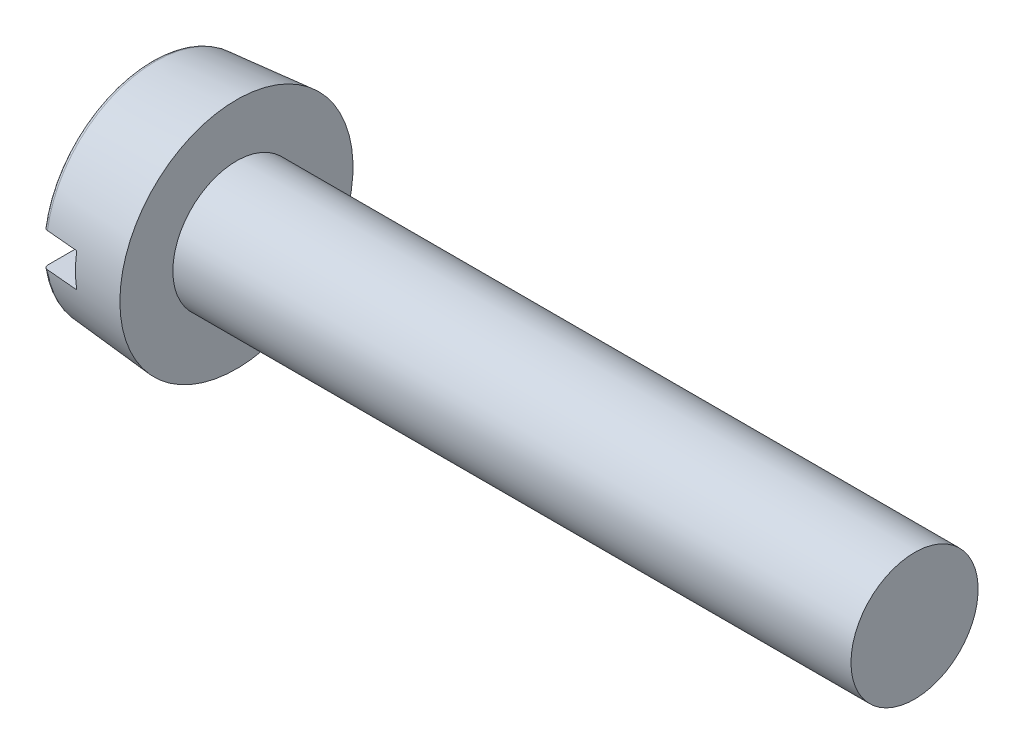
ISO-10303-21;
HEADER;
FILE_DESCRIPTION(('STEP AP214'),'2;1');
FILE_NAME('part.step','',(''),(''),'','','');
FILE_SCHEMA(('AUTOMOTIVE_DESIGN { 1 0 10303 214 1 1 1 1 }'));
ENDSEC;
DATA;
#1=APPLICATION_CONTEXT('core data for automotive mechanical design processes');
#2=APPLICATION_PROTOCOL_DEFINITION('international standard','automotive_design',2000,#1);
#3=PRODUCT_CONTEXT('',#1,'mechanical');
#4=PRODUCT('Part','Part','',(#3));
#5=PRODUCT_RELATED_PRODUCT_CATEGORY('part','',(#4));
#6=PRODUCT_DEFINITION_FORMATION('','',#4);
#7=PRODUCT_DEFINITION_CONTEXT('part definition',#1,'design');
#8=PRODUCT_DEFINITION('design','',#6,#7);
#9=PRODUCT_DEFINITION_SHAPE('','',#8);
#10=(LENGTH_UNIT() NAMED_UNIT(*) SI_UNIT(.MILLI.,.METRE.));
#11=(NAMED_UNIT(*) PLANE_ANGLE_UNIT() SI_UNIT($,.RADIAN.));
#12=(NAMED_UNIT(*) SI_UNIT($,.STERADIAN.) SOLID_ANGLE_UNIT());
#13=UNCERTAINTY_MEASURE_WITH_UNIT(LENGTH_MEASURE(1.E-05),#10,'distance_accuracy_value','');
#14=(GEOMETRIC_REPRESENTATION_CONTEXT(3) GLOBAL_UNCERTAINTY_ASSIGNED_CONTEXT((#13)) GLOBAL_UNIT_ASSIGNED_CONTEXT((#10,
#11,#12)) REPRESENTATION_CONTEXT('',''));
#15=CARTESIAN_POINT('',(0.,0.,0.));
#16=DIRECTION('',(0.,0.,1.));
#17=DIRECTION('',(1.,0.,0.));
#18=AXIS2_PLACEMENT_3D('',#15,#16,#17);
#19=CARTESIAN_POINT('',(0.,0.,0.));
#20=DIRECTION('',(-1.,0.,0.));
#21=DIRECTION('',(0.,0.,1.));
#22=AXIS2_PLACEMENT_3D('',#19,#20,#21);
#23=PLANE('',#22);
#24=DIRECTION('',(0.,0.,-1.));
#25=VECTOR('',#24,1.);
#26=CARTESIAN_POINT('',(0.,0.399999999999999,2.75));
#27=LINE('',#26,#25);
#28=CARTESIAN_POINT('',(0.,0.399999999999999,2.45096382768024));
#29=VERTEX_POINT('',#28);
#30=CARTESIAN_POINT('',(0.,0.399999999999999,-2.45096382768024));
#31=VERTEX_POINT('',#30);
#32=EDGE_CURVE('E103',#29,#31,#27,.T.);
#33=ORIENTED_EDGE('',*,*,#32,.F.);
#34=CARTESIAN_POINT('',(0.,0.,0.));
#35=DIRECTION('',(-1.,0.,0.));
#36=DIRECTION('',(0.,0.,1.));
#37=AXIS2_PLACEMENT_3D('',#34,#35,#36);
#38=CIRCLE('',#37,2.48338955554641);
#39=EDGE_CURVE('E105',#29,#31,#38,.T.);
#40=ORIENTED_EDGE('',*,*,#39,.T.);
#41=EDGE_LOOP('',(#33,#40));
#42=FACE_BOUND('',#41,.T.);
#43=ADVANCED_FACE('F35',(#42),#23,.T.);
#44=CARTESIAN_POINT('',(0.1,0.,0.));
#45=DIRECTION('',(-1.,0.,0.));
#46=DIRECTION('',(0.,0.,1.));
#47=AXIS2_PLACEMENT_3D('',#44,#45,#46);
#48=TOROIDAL_SURFACE('',#47,2.48338955554641,0.1);
#49=CARTESIAN_POINT('',(0.0289938380211767,0.399999999999999,-2.52228316549766));
#50=CARTESIAN_POINT('',(0.0329146400399018,0.399999999999999,-2.52628601737879));
#51=CARTESIAN_POINT('',(0.0371732059087869,0.399999999999999,-2.52996330795833));
#52=CARTESIAN_POINT('',(0.0462494374841135,0.399999999999999,-2.53655558833691));
#53=CARTESIAN_POINT('',(0.0510676904570537,0.399999999999999,-2.53946976679747));
#54=CARTESIAN_POINT('',(0.0611266188974553,0.399999999999999,-2.54444525866304));
#55=CARTESIAN_POINT('',(0.0663672780390162,0.399999999999999,-2.54650660501096));
#56=CARTESIAN_POINT('',(0.0771205298537048,0.399999999999999,-2.5497128714041));
#57=CARTESIAN_POINT('',(0.0826330564249989,0.399999999999999,-2.55085801306043));
#58=CARTESIAN_POINT('',(0.0937360108304339,0.399999999999999,-2.55219318080891));
#59=CARTESIAN_POINT('',(0.0993256947509518,0.399999999999999,-2.55238939597481));
#60=CARTESIAN_POINT('',(0.110458306622039,0.399999999999999,-2.55183747650024));
#61=CARTESIAN_POINT('',(0.116001234198318,0.399999999999999,-2.55108933430727));
#62=CARTESIAN_POINT('',(0.126865819783631,0.399999999999999,-2.54867516285271));
#63=CARTESIAN_POINT('',(0.132188090847036,0.399999999999999,-2.54701188972794));
#64=CARTESIAN_POINT('',(0.142479668135714,0.399999999999999,-2.54281935144472));
#65=CARTESIAN_POINT('',(0.147448970444547,0.399999999999999,-2.54029007667919));
#66=CARTESIAN_POINT('',(0.156919019556884,0.399999999999999,-2.53442699567865));
#67=CARTESIAN_POINT('',(0.161417530686885,0.399999999999999,-2.53108957986598));
#68=CARTESIAN_POINT('',(0.169797583318729,0.399999999999999,-2.52371398467404));
#69=CARTESIAN_POINT('',(0.173679096427556,0.399999999999999,-2.51967577306341));
#70=CARTESIAN_POINT('',(0.180758379631839,0.399999999999999,-2.51096934806693));
#71=CARTESIAN_POINT('',(0.183948691710374,0.399999999999999,-2.50629507144611));
#72=CARTESIAN_POINT('',(0.189510239570672,0.399999999999999,-2.49648236653712));
#73=CARTESIAN_POINT('',(0.191881421883503,0.399999999999999,-2.49134390797695));
#74=CARTESIAN_POINT('',(0.195767027940458,0.399999999999999,-2.480682205207));
#75=CARTESIAN_POINT('',(0.197270760971854,0.399999999999999,-2.47515506403468));
#76=CARTESIAN_POINT('',(0.199338128353478,0.399999999999999,-2.4639276342002));
#77=CARTESIAN_POINT('',(0.199901709526226,0.399999999999999,-2.45822733576238));
#78=CARTESIAN_POINT('',(0.20007548133907,0.399999999999999,-2.44676112412241));
#79=CARTESIAN_POINT('',(0.199677113345941,0.399999999999999,-2.44099507954687));
#80=CARTESIAN_POINT('',(0.197919889661746,0.399999999999999,-2.42961109138142));
#81=CARTESIAN_POINT('',(0.196561010768147,0.399999999999999,-2.42399315137259));
#82=CARTESIAN_POINT('',(0.192915627153958,0.399999999999999,-2.41305590565846));
#83=CARTESIAN_POINT('',(0.190627555523932,0.399999999999999,-2.40773712175833));
#84=CARTESIAN_POINT('',(0.185185000915827,0.399999999999999,-2.39756279520368));
#85=CARTESIAN_POINT('',(0.182030540035585,0.399999999999999,-2.39270724073845));
#86=CARTESIAN_POINT('',(0.174965864483063,0.399999999999999,-2.38363467595376));
#87=CARTESIAN_POINT('',(0.171060998294419,0.399999999999999,-2.37941350258364));
#88=CARTESIAN_POINT('',(0.162589830789106,0.399999999999999,-2.37169707517616));
#89=CARTESIAN_POINT('',(0.158023574903145,0.399999999999999,-2.36820177131908));
#90=CARTESIAN_POINT('',(0.148421596079081,0.399999999999999,-2.36208459946197));
#91=CARTESIAN_POINT('',(0.143392636404649,0.399999999999999,-2.35945211619946));
#92=CARTESIAN_POINT('',(0.132960042691406,0.399999999999999,-2.35508144798975));
#93=CARTESIAN_POINT('',(0.127556438263747,0.399999999999999,-2.35334319245586));
#94=CARTESIAN_POINT('',(0.116602502745338,0.399999999999999,-2.35083201602087));
#95=CARTESIAN_POINT('',(0.111054942498253,0.399999999999999,-2.35004699968965));
#96=CARTESIAN_POINT('',(0.0999070705254337,0.399999999999999,-2.3494263065429));
#97=CARTESIAN_POINT('',(0.0943067613611998,0.399999999999999,-2.34959058386431));
#98=CARTESIAN_POINT('',(0.0832511443149567,0.399999999999999,-2.35085902950957));
#99=CARTESIAN_POINT('',(0.0777951256899427,0.399999999999999,-2.3519570180145));
#100=CARTESIAN_POINT('',(0.0671440893672216,0.399999999999999,-2.35505088710293));
#101=CARTESIAN_POINT('',(0.061949072118474,0.399999999999999,-2.35704676923086));
#102=CARTESIAN_POINT('',(0.0519500535749681,0.399999999999999,-2.36188301447907));
#103=CARTESIAN_POINT('',(0.0471472182076565,0.399999999999999,-2.36472578664258));
#104=CARTESIAN_POINT('',(0.0380802947550965,0.399999999999999,-2.37116917771983));
#105=CARTESIAN_POINT('',(0.033816233965636,0.399999999999999,-2.37476983500548));
#106=CARTESIAN_POINT('',(0.0258978392798655,0.399999999999999,-2.38266730942151));
#107=CARTESIAN_POINT('',(0.0222505790304375,0.399999999999999,-2.38697121737475));
#108=CARTESIAN_POINT('',(0.0157188388685997,0.399999999999999,-2.39612333377568));
#109=CARTESIAN_POINT('',(0.0128344147286456,0.399999999999999,-2.40097158198427));
#110=CARTESIAN_POINT('',(0.00786953684593841,0.399999999999999,-2.41114518595604));
#111=CARTESIAN_POINT('',(0.00580049504437295,0.399999999999999,-2.41647611188959));
#112=CARTESIAN_POINT('',(0.00257668282239868,0.399999999999999,-2.4274074136993));
#113=CARTESIAN_POINT('',(0.0014219342122886,0.399999999999999,-2.43300779599991));
#114=CARTESIAN_POINT('',(4.98309082451504E-05,0.399999999999999,-2.44437919860998));
#115=CARTESIAN_POINT('',(-0.000158040154988933,0.399999999999999,-2.45015136490808));
#116=CARTESIAN_POINT('',(0.000395629680354001,0.399999999999999,-2.46165070249477));
#117=CARTESIAN_POINT('',(0.00115743264880536,0.399999999999999,-2.46737786119837));
#118=CARTESIAN_POINT('',(0.00363465605126339,0.399999999999999,-2.47863907342415));
#119=CARTESIAN_POINT('',(0.00535281370350065,0.399999999999999,-2.48417252398631));
#120=CARTESIAN_POINT('',(0.00969850669250414,0.399999999999999,-2.49486489969062));
#121=CARTESIAN_POINT('',(0.0123249394519192,0.399999999999999,-2.50002426979425));
#122=CARTESIAN_POINT('',(0.0173136943959979,0.399999999999999,-2.50805181152184));
#123=CARTESIAN_POINT('',(0.01943008264062,0.399999999999999,-2.51107561025656));
#124=CARTESIAN_POINT('',(0.0239801784125796,0.399999999999999,-2.51687431501129));
#125=CARTESIAN_POINT('',(0.0264138847052197,0.399999999999999,-2.5196492219997));
#126=CARTESIAN_POINT('',(0.0289938380211767,0.399999999999999,-2.52228316549766));
#127=B_SPLINE_CURVE_WITH_KNOTS('',3,(#49,#50,#51,#52,#53,#54,#55,#56,#57,#58,#59,#60,#61,#62,
#63,#64,#65,#66,#67,#68,#69,#70,#71,#72,#73,#74,#75,#76,#77,#78,#79,#80,#81,#82,#83,#84,#85,#86,
#87,#88,#89,#90,#91,#92,#93,#94,#95,#96,#97,#98,#99,#100,#101,#102,#103,#104,#105,#106,#107,
#108,#109,#110,#111,#112,#113,#114,#115,#116,#117,#118,#119,#120,#121,#122,#123,#124,#125,#126),
.UNSPECIFIED.,.T.,.F.,(4,2,2,2,2,2,2,2,2,2,2,2,2,2,2,2,2,2,2,2,2,2,2,2,2,2,2,2,2,2,2,2,2,2,2,2,
2,2,4),(0.,0.0167962438770804,0.0336102736228912,0.0504236538216825,0.06723296597852,
0.0839324954656499,0.100632158508098,0.117281799647169,0.133931625497132,0.150657236214899,
0.167383616389182,0.184282358747594,0.201182203967944,0.218286107817179,0.235390979075726,
0.252648595290838,0.269906628402956,0.287193885606231,0.304480701927405,0.321648593971803,
0.338815307316328,0.355762112546912,0.372707579860325,0.389435704571816,0.406163021106999,
0.422780481006365,0.439397969489147,0.456063186523275,0.47272924752445,0.489575093862967,
0.506422171494332,0.523497308438318,0.540572852694337,0.55781904957641,0.575069908508114,
0.592370397548948,0.609649958399181,0.620702210843321,0.631754420283977),.UNSPECIFIED.);
#128=CARTESIAN_POINT('',(0.0912844257252334,0.399999999999999,-2.5518494518816));
#129=VERTEX_POINT('',#128);
#130=EDGE_CURVE('E59',#31,#129,#127,.T.);
#131=ORIENTED_EDGE('',*,*,#130,.F.);
#132=ORIENTED_EDGE('',*,*,#39,.F.);
#133=CARTESIAN_POINT('',(0.0367676987021643,0.399999999999999,2.37243473528728));
#134=CARTESIAN_POINT('',(0.0410691072562518,0.399999999999999,2.36887462682049));
#135=CARTESIAN_POINT('',(0.0456712476146379,0.399999999999999,2.36567202074306));
#136=CARTESIAN_POINT('',(0.0553504912178822,0.399999999999999,2.36008032650183));
#137=CARTESIAN_POINT('',(0.0604280839551132,0.399999999999999,2.35769208875703));
#138=CARTESIAN_POINT('',(0.0709135886904199,0.399999999999999,2.35380489827384));
#139=CARTESIAN_POINT('',(0.0763214938192331,0.399999999999999,2.35230592704897));
#140=CARTESIAN_POINT('',(0.0873116719417479,0.399999999999999,2.35024450872371));
#141=CARTESIAN_POINT('',(0.0928939027986416,0.399999999999999,2.34968183706536));
#142=CARTESIAN_POINT('',(0.104036601297581,0.399999999999999,2.34951039508072));
#143=CARTESIAN_POINT('',(0.109596974662459,0.399999999999999,2.34989545024077));
#144=CARTESIAN_POINT('',(0.120573920357346,0.399999999999999,2.35159460899385));
#145=CARTESIAN_POINT('',(0.125990490202903,0.399999999999999,2.35290872862725));
#146=CARTESIAN_POINT('',(0.136522391247531,0.399999999999999,2.35642416504567));
#147=CARTESIAN_POINT('',(0.141637967615106,0.399999999999999,2.35862474798458));
#148=CARTESIAN_POINT('',(0.151431222534294,0.399999999999999,2.36384674458521));
#149=CARTESIAN_POINT('',(0.156108887376012,0.399999999999999,2.36686818393429));
#150=CARTESIAN_POINT('',(0.164936002938918,0.399999999999999,2.37367095440966));
#151=CARTESIAN_POINT('',(0.16908079389346,0.399999999999999,2.3774583297866));
#152=CARTESIAN_POINT('',(0.176685910750912,0.399999999999999,2.38566704388047));
#153=CARTESIAN_POINT('',(0.180146192360979,0.399999999999999,2.39008842359027));
#154=CARTESIAN_POINT('',(0.186332746435633,0.399999999999999,2.39950205527751));
#155=CARTESIAN_POINT('',(0.189048713902265,0.399999999999999,2.40450107962601));
#156=CARTESIAN_POINT('',(0.193614409893133,0.399999999999999,2.41488017557624));
#157=CARTESIAN_POINT('',(0.195464077650946,0.399999999999999,2.42026027387786));
#158=CARTESIAN_POINT('',(0.198266231334811,0.399999999999999,2.43131856240102));
#159=CARTESIAN_POINT('',(0.199207620171234,0.399999999999999,2.43699956654937));
#160=CARTESIAN_POINT('',(0.20012925691986,0.399999999999999,2.4484391128062));
#161=CARTESIAN_POINT('',(0.200109464431673,0.399999999999999,2.45419765816372));
#162=CARTESIAN_POINT('',(0.199105792419158,0.399999999999999,2.46566309979117));
#163=CARTESIAN_POINT('',(0.198116473192368,0.399999999999999,2.47136952123461));
#164=CARTESIAN_POINT('',(0.195191128966346,0.399999999999999,2.48253449565389));
#165=CARTESIAN_POINT('',(0.193255106776879,0.399999999999999,2.48799304936533));
#166=CARTESIAN_POINT('',(0.188494675278442,0.399999999999999,2.49848893070217));
#167=CARTESIAN_POINT('',(0.185672880951563,0.399999999999999,2.50352744366316));
#168=CARTESIAN_POINT('',(0.17921549855744,0.399999999999999,2.51305299197626));
#169=CARTESIAN_POINT('',(0.175579948629359,0.399999999999999,2.51754005315861));
#170=CARTESIAN_POINT('',(0.167635478825505,0.399999999999999,2.52578731588122));
#171=CARTESIAN_POINT('',(0.163333512373971,0.399999999999999,2.5295542142048));
#172=CARTESIAN_POINT('',(0.154151555490121,0.399999999999999,2.53630156216166));
#173=CARTESIAN_POINT('',(0.149271604711318,0.399999999999999,2.53928206570155));
#174=CARTESIAN_POINT('',(0.13913635307135,0.399999999999999,2.54433379308572));
#175=CARTESIAN_POINT('',(0.133886369113007,0.399999999999999,2.54641568563766));
#176=CARTESIAN_POINT('',(0.123109394747461,0.399999999999999,2.54965893225548));
#177=CARTESIAN_POINT('',(0.117582421034199,0.399999999999999,2.55082034172732));
#178=CARTESIAN_POINT('',(0.106464698916145,0.399999999999999,2.55218028189334));
#179=CARTESIAN_POINT('',(0.100875054594367,0.399999999999999,2.55238785185234));
#180=CARTESIAN_POINT('',(0.0897407847209886,0.399999999999999,2.55185843737951));
#181=CARTESIAN_POINT('',(0.0841961579348967,0.399999999999999,2.55112147893765));
#182=CARTESIAN_POINT('',(0.073326565726689,0.399999999999999,2.54872918263962));
#183=CARTESIAN_POINT('',(0.0680009847337695,0.399999999999999,2.54707663871121));
#184=CARTESIAN_POINT('',(0.0577010526378296,0.399999999999999,2.54290481605141));
#185=CARTESIAN_POINT('',(0.0527267057044026,0.399999999999999,2.54038552703274));
#186=CARTESIAN_POINT('',(0.0432451955154218,0.399999999999999,2.53454156724995));
#187=CARTESIAN_POINT('',(0.0387402389480661,0.399999999999999,2.53121331773258));
#188=CARTESIAN_POINT('',(0.0303458654217718,0.399999999999999,2.52385482922166));
#189=CARTESIAN_POINT('',(0.0264564786942823,0.399999999999999,2.51982455577117));
#190=CARTESIAN_POINT('',(0.0193602742266986,0.399999999999999,2.51113277232454));
#191=CARTESIAN_POINT('',(0.0161608831052451,0.399999999999999,2.50646520000313));
#192=CARTESIAN_POINT('',(0.0105801862776837,0.399999999999999,2.49666430232761));
#193=CARTESIAN_POINT('',(0.00819893477648342,0.399999999999999,2.491530946142));
#194=CARTESIAN_POINT('',(0.00429230007908598,0.399999999999999,2.48087765570879));
#195=CARTESIAN_POINT('',(0.00277761888662455,0.399999999999999,2.47535379620009));
#196=CARTESIAN_POINT('',(0.00068799544056719,0.399999999999999,2.46413127035624));
#197=CARTESIAN_POINT('',(0.000113070892212571,0.399999999999999,2.45843260072968));
#198=CARTESIAN_POINT('',(-8.37002456024676E-05,0.399999999999999,2.44696818040157));
#199=CARTESIAN_POINT('',(0.00030294133576769,0.399999999999999,2.44120228266165));
#200=CARTESIAN_POINT('',(0.00203701001733569,0.399999999999999,2.42981508207598));
#201=CARTESIAN_POINT('',(0.00338469494754012,0.399999999999999,2.42419381845226));
#202=CARTESIAN_POINT('',(0.00700896577894925,0.399999999999999,2.41324562761761));
#203=CARTESIAN_POINT('',(0.00928760515722943,0.399999999999999,2.40791938083122));
#204=CARTESIAN_POINT('',(0.0147114792186617,0.399999999999999,2.39773348978099));
#205=CARTESIAN_POINT('',(0.0178556585516149,0.399999999999999,2.39287328693998));
#206=CARTESIAN_POINT('',(0.0236503626604921,0.399999999999999,2.38539954815907));
#207=CARTESIAN_POINT('',(0.0260726096208588,0.399999999999999,2.38260604033144));
#208=CARTESIAN_POINT('',(0.0312086078085589,0.399999999999999,2.37730112356));
#209=CARTESIAN_POINT('',(0.0339223576900255,0.399999999999999,2.37478971331387));
#210=CARTESIAN_POINT('',(0.0367676987021643,0.399999999999999,2.37243473528728));
#211=B_SPLINE_CURVE_WITH_KNOTS('',3,(#133,#134,#135,#136,#137,#138,#139,#140,#141,#142,#143,
#144,#145,#146,#147,#148,#149,#150,#151,#152,#153,#154,#155,#156,#157,#158,#159,#160,#161,#162,
#163,#164,#165,#166,#167,#168,#169,#170,#171,#172,#173,#174,#175,#176,#177,#178,#179,#180,#181,
#182,#183,#184,#185,#186,#187,#188,#189,#190,#191,#192,#193,#194,#195,#196,#197,#198,#199,#200,
#201,#202,#203,#204,#205,#206,#207,#208,#209,#210),.UNSPECIFIED.,.T.,.F.,(4,2,2,2,2,2,2,2,2,2,2,
2,2,2,2,2,2,2,2,2,2,2,2,2,2,2,2,2,2,2,2,2,2,2,2,2,2,2,4),(0.,0.0167374978406355,
0.0334924209723803,0.0502469957829488,0.0669975516708022,0.0836392656129615,0.100281266882441,
0.116909519525703,0.133538292583203,0.150303803185788,0.167070398286947,0.18405857971598,
0.201047952599288,0.218242362613188,0.235437495343469,0.252729660021829,0.270021773378246,
0.287263309496308,0.304504037705845,0.321575685446243,0.338646162637365,0.35550798995053,
0.372368802234774,0.389069495340301,0.405769728913956,0.422419279849294,0.439069028402679,
0.455793818907913,0.472519430535029,0.489416954805598,0.506315598386582,0.523418666684378,
0.540522057204383,0.557776961903069,0.57503649751328,0.592334311120995,0.609611126268918,
0.620682873655479,0.631754569926062),.UNSPECIFIED.);
#212=CARTESIAN_POINT('',(0.0912844257243818,0.399999999999999,2.55184945188522));
#213=VERTEX_POINT('',#212);
#214=EDGE_CURVE('E95',#213,#29,#211,.T.);
#215=ORIENTED_EDGE('',*,*,#214,.F.);
#216=CARTESIAN_POINT('',(0.0912844257252333,0.,0.));
#217=DIRECTION('',(-1.,0.,0.));
#218=DIRECTION('',(0.,0.,1.));
#219=AXIS2_PLACEMENT_3D('',#216,#217,#218);
#220=CIRCLE('',#219,2.58300902535558);
#221=EDGE_CURVE('E109',#129,#213,#220,.F.);
#222=ORIENTED_EDGE('',*,*,#221,.F.);
#223=EDGE_LOOP('',(#131,#132,#215,#222));
#224=FACE_BOUND('',#223,.T.);
#225=ADVANCED_FACE('F186',(#224),#48,.T.);
#226=CARTESIAN_POINT('',(-25.4,0.,0.));
#227=DIRECTION('',(-1.,0.,0.));
#228=DIRECTION('',(0.,0.,1.));
#229=AXIS2_PLACEMENT_3D('',#226,#227,#228);
#230=CYLINDRICAL_SURFACE('',#229,1.5);
#231=CARTESIAN_POINT('',(18.,0.,0.));
#232=DIRECTION('',(-1.,0.,0.));
#233=DIRECTION('',(0.,0.,1.));
#234=AXIS2_PLACEMENT_3D('',#231,#232,#233);
#235=CIRCLE('',#234,1.5);
#236=CARTESIAN_POINT('',(18.,0.,1.5));
#237=VERTEX_POINT('',#236);
#238=EDGE_CURVE('E106',#237,#237,#235,.T.);
#239=ORIENTED_EDGE('',*,*,#238,.T.);
#240=EDGE_LOOP('',(#239));
#241=FACE_BOUND('',#240,.T.);
#242=CARTESIAN_POINT('',(2.,0.,0.));
#243=DIRECTION('',(-1.,0.,0.));
#244=DIRECTION('',(0.,0.,1.));
#245=AXIS2_PLACEMENT_3D('',#242,#243,#244);
#246=CIRCLE('',#245,1.5);
#247=CARTESIAN_POINT('',(2.,0.,1.5));
#248=VERTEX_POINT('',#247);
#249=EDGE_CURVE('E173',#248,#248,#246,.T.);
#250=ORIENTED_EDGE('',*,*,#249,.F.);
#251=EDGE_LOOP('',(#250));
#252=FACE_BOUND('',#251,.T.);
#253=ADVANCED_FACE('F183',(#241,#252),#230,.T.);
#254=CARTESIAN_POINT('',(18.,1.5,0.));
#255=DIRECTION('',(1.,0.,0.));
#256=DIRECTION('',(0.,0.,-1.));
#257=AXIS2_PLACEMENT_3D('',#254,#255,#256);
#258=PLANE('',#257);
#259=ORIENTED_EDGE('',*,*,#238,.F.);
#260=EDGE_LOOP('',(#259));
#261=FACE_BOUND('',#260,.T.);
#262=ADVANCED_FACE('F185',(#261),#258,.T.);
#263=DIRECTION('',(0.,0.,1.));
#264=VECTOR('',#263,1.);
#265=CARTESIAN_POINT('',(0.,-0.4,-2.75));
#266=LINE('',#265,#264);
#267=CARTESIAN_POINT('',(0.,-0.4,-2.45096382768024));
#268=VERTEX_POINT('',#267);
#269=CARTESIAN_POINT('',(0.,-0.4,2.45096382768024));
#270=VERTEX_POINT('',#269);
#271=EDGE_CURVE('E51',#268,#270,#266,.T.);
#272=ORIENTED_EDGE('',*,*,#271,.F.);
#273=EDGE_CURVE('E101',#268,#270,#38,.T.);
#274=ORIENTED_EDGE('',*,*,#273,.T.);
#275=EDGE_LOOP('',(#272,#274));
#276=FACE_BOUND('',#275,.T.);
#277=ADVANCED_FACE('F100',(#276),#23,.T.);
#278=CARTESIAN_POINT('',(0.,0.,0.));
#279=DIRECTION('',(1.,0.,0.));
#280=DIRECTION('',(0.,0.,-1.));
#281=AXIS2_PLACEMENT_3D('',#278,#279,#280);
#282=CONICAL_SURFACE('',#281,2.57502267294815,0.0872664625997164);
#283=CARTESIAN_POINT('',(5.21123588736544,0.399999999999999,3.00443640584799));
#284=CARTESIAN_POINT('',(4.41342358696222,0.399999999999999,2.93401988873196));
#285=CARTESIAN_POINT('',(3.61561486907634,0.399999999999999,2.86356274948076));
#286=CARTESIAN_POINT('',(2.0200069246513,0.399999999999999,2.72254136292326));
#287=CARTESIAN_POINT('',(1.22220769811185,0.399999999999999,2.65197711562021));
#288=CARTESIAN_POINT('',(-0.373378996688641,0.399999999999999,2.51071564393346));
#289=CARTESIAN_POINT('',(-1.17116646494953,0.399999999999999,2.44001841954794));
#290=CARTESIAN_POINT('',(-2.76672581923324,0.399999999999999,2.298448092182));
#291=CARTESIAN_POINT('',(-3.56449770525557,0.399999999999999,2.22757498919618));
#292=CARTESIAN_POINT('',(-4.36225986914578,0.399999999999999,2.15659249784001));
#293=B_SPLINE_CURVE_WITH_KNOTS('',3,(#283,#284,#285,#286,#287,#288,#289,#290,#291,#292),
.UNSPECIFIED.,.F.,.F.,(4,2,2,2,4),(0.,2.40274147318214,4.80548287330205,7.20822430613117,
9.6109658126378),.UNSPECIFIED.);
#294=CARTESIAN_POINT('',(0.85,0.399999999999999,2.61901832187334));
#295=VERTEX_POINT('',#294);
#296=EDGE_CURVE('E162',#295,#213,#293,.T.);
#297=ORIENTED_EDGE('',*,*,#296,.F.);
#298=CARTESIAN_POINT('',(0.85,0.,0.));
#299=DIRECTION('',(1.,0.,0.));
#300=DIRECTION('',(0.,0.,-1.));
#301=AXIS2_PLACEMENT_3D('',#298,#299,#300);
#302=CIRCLE('',#301,2.64938803694519);
#303=CARTESIAN_POINT('',(0.85,-0.4,2.61901832187334));
#304=VERTEX_POINT('',#303);
#305=EDGE_CURVE('E11',#304,#295,#302,.F.);
#306=ORIENTED_EDGE('',*,*,#305,.F.);
#307=CARTESIAN_POINT('',(-4.36225986914578,-0.4,2.15659249784001));
#308=CARTESIAN_POINT('',(-3.02252879329932,-0.4,2.27578971400985));
#309=CARTESIAN_POINT('',(-1.68277158070833,-0.4,2.3946924855258));
#310=CARTESIAN_POINT('',(-0.0871929715729522,-0.4,2.5360455579839));
#311=CARTESIAN_POINT('',(0.168610376643269,-0.4,2.55869953286896));
#312=CARTESIAN_POINT('',(2.02000114161502,-0.400000000000001,2.72260692865391));
#313=CARTESIAN_POINT('',(3.6156124883095,-0.400000000000001,2.86359016848939));
#314=CARTESIAN_POINT('',(5.21123588736544,-0.4,3.00443640584799));
#315=B_SPLINE_CURVE_WITH_KNOTS('',3,(#307,#308,#309,#310,#311,#312,#313,#314),.UNSPECIFIED.,.F.,
.F.,(4,2,2,4),(0.,4.03506939923899,4.80548292410975,9.61096578658458),.UNSPECIFIED.);
#316=CARTESIAN_POINT('',(0.0912844257241123,-0.4,2.55184945188158));
#317=VERTEX_POINT('',#316);
#318=EDGE_CURVE('E138',#317,#304,#315,.T.);
#319=ORIENTED_EDGE('',*,*,#318,.F.);
#320=CARTESIAN_POINT('',(0.0912844257452064,-0.4,-2.55184945199817));
#321=VERTEX_POINT('',#320);
#322=EDGE_CURVE('E115',#317,#321,#220,.F.);
#323=ORIENTED_EDGE('',*,*,#322,.T.);
#324=CARTESIAN_POINT('',(5.21123588736544,-0.399999999999999,-3.00443640584799));
#325=CARTESIAN_POINT('',(4.41342358696222,-0.4,-2.93401988873196));
#326=CARTESIAN_POINT('',(3.61561486907634,-0.4,-2.86356274948076));
#327=CARTESIAN_POINT('',(2.0200069246513,-0.4,-2.72254136292326));
#328=CARTESIAN_POINT('',(1.22220769811185,-0.4,-2.65197711562021));
#329=CARTESIAN_POINT('',(-0.373378996688641,-0.4,-2.51071564393346));
#330=CARTESIAN_POINT('',(-1.17116646494953,-0.4,-2.44001841954794));
#331=CARTESIAN_POINT('',(-2.76672581923324,-0.4,-2.298448092182));
#332=CARTESIAN_POINT('',(-3.56449770525557,-0.4,-2.22757498919618));
#333=CARTESIAN_POINT('',(-4.36225986914578,-0.4,-2.15659249784001));
#334=B_SPLINE_CURVE_WITH_KNOTS('',3,(#324,#325,#326,#327,#328,#329,#330,#331,#332,#333),
.UNSPECIFIED.,.F.,.F.,(4,2,2,2,4),(0.,2.40274147318214,4.80548287330205,7.20822430613117,
9.6109658126378),.UNSPECIFIED.);
#335=CARTESIAN_POINT('',(0.85,-0.4,-2.61901832187334));
#336=VERTEX_POINT('',#335);
#337=EDGE_CURVE('E90',#336,#321,#334,.T.);
#338=ORIENTED_EDGE('',*,*,#337,.F.);
#339=CARTESIAN_POINT('',(0.85,0.399999999999999,-2.61901832187334));
#340=VERTEX_POINT('',#339);
#341=EDGE_CURVE('E40',#340,#336,#302,.F.);
#342=ORIENTED_EDGE('',*,*,#341,.F.);
#343=CARTESIAN_POINT('',(-4.36225986914578,0.399999999999999,-2.15659249784001));
#344=CARTESIAN_POINT('',(-3.0225287932993,0.399999999999999,-2.27578971400985));
#345=CARTESIAN_POINT('',(-1.68277158070832,0.399999999999999,-2.3946924855258));
#346=CARTESIAN_POINT('',(-0.087192971572953,0.399999999999999,-2.5360455579839));
#347=CARTESIAN_POINT('',(0.168610376643268,0.399999999999999,-2.55869953286896));
#348=CARTESIAN_POINT('',(2.02000114161503,0.399999999999999,-2.72260692865391));
#349=CARTESIAN_POINT('',(3.61561248830953,0.399999999999999,-2.86359016848939));
#350=CARTESIAN_POINT('',(5.21123588736544,0.399999999999999,-3.00443640584799));
#351=B_SPLINE_CURVE_WITH_KNOTS('',3,(#343,#344,#345,#346,#347,#348,#349,#350),.UNSPECIFIED.,.F.,
.F.,(4,2,2,4),(0.,4.03506939923899,4.80548292410975,9.61096578658458),.UNSPECIFIED.);
#352=EDGE_CURVE('E167',#129,#340,#351,.T.);
#353=ORIENTED_EDGE('',*,*,#352,.F.);
#354=ORIENTED_EDGE('',*,*,#221,.T.);
#355=EDGE_LOOP('',(#297,#306,#319,#323,#338,#342,#353,#354));
#356=FACE_BOUND('',#355,.T.);
#357=CARTESIAN_POINT('',(2.,0.,0.));
#358=DIRECTION('',(-1.,0.,0.));
#359=DIRECTION('',(0.,0.,1.));
#360=AXIS2_PLACEMENT_3D('',#357,#358,#359);
#361=CIRCLE('',#360,2.75);
#362=CARTESIAN_POINT('',(2.,0.,2.75));
#363=VERTEX_POINT('',#362);
#364=EDGE_CURVE('E111',#363,#363,#361,.T.);
#365=ORIENTED_EDGE('',*,*,#364,.T.);
#366=EDGE_LOOP('',(#365));
#367=FACE_BOUND('',#366,.T.);
#368=ADVANCED_FACE('F151',(#356,#367),#282,.T.);
#369=CARTESIAN_POINT('',(2.,1.5,0.));
#370=DIRECTION('',(-1.,0.,0.));
#371=DIRECTION('',(0.,0.,1.));
#372=AXIS2_PLACEMENT_3D('',#369,#370,#371);
#373=PLANE('',#372);
#374=ORIENTED_EDGE('',*,*,#364,.F.);
#375=EDGE_LOOP('',(#374));
#376=FACE_BOUND('',#375,.T.);
#377=ORIENTED_EDGE('',*,*,#249,.T.);
#378=EDGE_LOOP('',(#377));
#379=FACE_BOUND('',#378,.T.);
#380=ADVANCED_FACE('F155',(#376,#379),#373,.F.);
#381=CARTESIAN_POINT('',(0.0289938380211767,-0.4,-2.52228316549766));
#382=CARTESIAN_POINT('',(0.0250040691259329,-0.4,-2.51820918183003));
#383=CARTESIAN_POINT('',(0.0213583190112091,-0.4,-2.51379201367196));
#384=CARTESIAN_POINT('',(0.0148592785644257,-0.4,-2.50440306026762));
#385=CARTESIAN_POINT('',(0.0120070700796542,-0.4,-2.49943053069829));
#386=CARTESIAN_POINT('',(0.0071777034792546,-0.4,-2.48908271582266));
#387=CARTESIAN_POINT('',(0.00519971746694669,-0.4,-2.48370781723002));
#388=CARTESIAN_POINT('',(0.00216717495668331,-0.4,-2.47270542437941));
#389=CARTESIAN_POINT('',(0.00111238322136118,-0.4,-2.4670779948528));
#390=CARTESIAN_POINT('',(-5.255820594518E-05,-0.4,-2.45568286085502));
#391=CARTESIAN_POINT('',(-0.000155467825421177,-0.4,-2.44991441534212));
#392=CARTESIAN_POINT('',(0.000604499959018277,-0.4,-2.43844109806142));
#393=CARTESIAN_POINT('',(0.00146745336414963,-0.4,-2.43273623133216));
#394=CARTESIAN_POINT('',(0.00414151157260947,-0.4,-2.42152987250594));
#395=CARTESIAN_POINT('',(0.00595623339048447,-0.4,-2.41602924255959));
#396=CARTESIAN_POINT('',(0.0104876390060401,-0.4,-2.40541275972393));
#397=CARTESIAN_POINT('',(0.013204310000063,-0.4,-2.40029690137383));
#398=CARTESIAN_POINT('',(0.0194512493609959,-0.4,-2.39062289289039));
#399=CARTESIAN_POINT('',(0.0229775960031601,-0.4,-2.38606221159139));
#400=CARTESIAN_POINT('',(0.0307542280705709,-0.4,-2.37760643337986));
#401=CARTESIAN_POINT('',(0.0350044686960856,-0.4,-2.37371129530862));
#402=CARTESIAN_POINT('',(0.0440555019555722,-0.4,-2.3667470396541));
#403=CARTESIAN_POINT('',(0.0488492409468842,-0.4,-2.36366875652182));
#404=CARTESIAN_POINT('',(0.0588909820215909,-0.4,-2.3583735233016));
#405=CARTESIAN_POINT('',(0.0641389481441076,-0.4,-2.35615650510399));
#406=CARTESIAN_POINT('',(0.0748640783279187,-0.4,-2.35267719664892));
#407=CARTESIAN_POINT('',(0.0803372009928291,-0.4,-2.35140244386474));
#408=CARTESIAN_POINT('',(0.091420226444799,-0.4,-2.34979886854023));
#409=CARTESIAN_POINT('',(0.0970301209943438,-0.4,-2.34946998917295));
#410=CARTESIAN_POINT('',(0.108175670502413,-0.4,-2.34976708273981));
#411=CARTESIAN_POINT('',(0.11371154750579,-0.4,-2.35038480500947));
#412=CARTESIAN_POINT('',(0.124600906547844,-0.4,-2.35254069219937));
#413=CARTESIAN_POINT('',(0.129954390579145,-0.4,-2.35407884706056));
#414=CARTESIAN_POINT('',(0.140330562478325,-0.4,-2.35802931008484));
#415=CARTESIAN_POINT('',(0.145353122327478,-0.4,-2.36044195422667));
#416=CARTESIAN_POINT('',(0.154926879209599,-0.4,-2.36606888937863));
#417=CARTESIAN_POINT('',(0.159478058010393,-0.4,-2.36928321137984));
#418=CARTESIAN_POINT('',(0.168025501299987,-0.4,-2.37645214423981));
#419=CARTESIAN_POINT('',(0.172016319852358,-0.4,-2.38041324620994));
#420=CARTESIAN_POINT('',(0.179287042308478,-0.4,-2.3889414041015));
#421=CARTESIAN_POINT('',(0.182566897622746,-0.4,-2.3935085014042));
#422=CARTESIAN_POINT('',(0.188369159015882,-0.4,-2.40318459258693));
#423=CARTESIAN_POINT('',(0.190880811711646,-0.4,-2.40830003507254));
#424=CARTESIAN_POINT('',(0.195020891957927,-0.4,-2.41887665144677));
#425=CARTESIAN_POINT('',(0.196649260076486,-0.4,-2.42433784857194));
#426=CARTESIAN_POINT('',(0.198994072160015,-0.4,-2.43551846416643));
#427=CARTESIAN_POINT('',(0.199699802934894,-0.4,-2.44124013143329));
#428=CARTESIAN_POINT('',(0.200145599532922,-0.4,-2.45272108096227));
#429=CARTESIAN_POINT('',(0.199885628830452,-0.4,-2.45848036463892));
#430=CARTESIAN_POINT('',(0.198402716236481,-0.4,-2.46990089334109));
#431=CARTESIAN_POINT('',(0.197175332540678,-0.4,-2.47556156274737));
#432=CARTESIAN_POINT('',(0.193783964811841,-0.4,-2.48659519893132));
#433=CARTESIAN_POINT('',(0.191619990295665,-0.4,-2.49196816863173));
#434=CARTESIAN_POINT('',(0.186423491809559,-0.4,-2.5022498657427));
#435=CARTESIAN_POINT('',(0.183394426113028,-0.4,-2.50716034009667));
#436=CARTESIAN_POINT('',(0.17654674686308,-0.4,-2.51639609907409));
#437=CARTESIAN_POINT('',(0.17272817212622,-0.4,-2.52072141244994));
#438=CARTESIAN_POINT('',(0.164451603414078,-0.4,-2.52861521808819));
#439=CARTESIAN_POINT('',(0.160000663078315,-0.4,-2.5321911048007));
#440=CARTESIAN_POINT('',(0.150555440028442,-0.4,-2.53853392400498));
#441=CARTESIAN_POINT('',(0.145561193801723,-0.4,-2.54130091077496));
#442=CARTESIAN_POINT('',(0.135236369590601,-0.4,-2.54591243640717));
#443=CARTESIAN_POINT('',(0.129910608025947,-0.4,-2.54776776094683));
#444=CARTESIAN_POINT('',(0.119021928101675,-0.4,-2.55054885934361));
#445=CARTESIAN_POINT('',(0.113459032918954,-0.4,-2.55147472382786));
#446=CARTESIAN_POINT('',(0.102307195571539,-0.4,-2.55236453620601));
#447=CARTESIAN_POINT('',(0.0967189330552632,-0.4,-2.55233702605628));
#448=CARTESIAN_POINT('',(0.0856253047271053,-0.4,-2.55134185745125));
#449=CARTESIAN_POINT('',(0.0801199583532402,-0.4,-2.55037398192564));
#450=CARTESIAN_POINT('',(0.0693593931696268,-0.4,-2.5475299876823));
#451=CARTESIAN_POINT('',(0.064103784701781,-0.4,-2.54565533854207));
#452=CARTESIAN_POINT('',(0.0539843368990692,-0.4,-2.54105571590675));
#453=CARTESIAN_POINT('',(0.0491200334774596,-0.4,-2.53833176895425));
#454=CARTESIAN_POINT('',(0.0417210877997128,-0.4,-2.53333714733838));
#455=CARTESIAN_POINT('',(0.0390206414531836,-0.4,-2.53130731123891));
#456=CARTESIAN_POINT('',(0.0338378944269701,-0.4,-2.5269861226631));
#457=CARTESIAN_POINT('',(0.0313555927448639,-0.4,-2.5246947713886));
#458=CARTESIAN_POINT('',(0.0289938380211767,-0.4,-2.52228316549766));
#459=B_SPLINE_CURVE_WITH_KNOTS('',3,(#381,#382,#383,#384,#385,#386,#387,#388,#389,#390,#391,
#392,#393,#394,#395,#396,#397,#398,#399,#400,#401,#402,#403,#404,#405,#406,#407,#408,#409,#410,
#411,#412,#413,#414,#415,#416,#417,#418,#419,#420,#421,#422,#423,#424,#425,#426,#427,#428,#429,
#430,#431,#432,#433,#434,#435,#436,#437,#438,#439,#440,#441,#442,#443,#444,#445,#446,#447,#448,
#449,#450,#451,#452,#453,#454,#455,#456,#457,#458),.UNSPECIFIED.,.T.,.F.,(4,2,2,2,2,2,2,2,2,2,2,
2,2,2,2,2,2,2,2,2,2,2,2,2,2,2,2,2,2,2,2,2,2,2,2,2,2,2,4),(0.,0.0170942392389229,
0.0342116703729638,0.0513128562267134,0.0684096832903606,0.0856364438942346,0.102864560121804,
0.120158628073267,0.137452450536553,0.154664213002626,0.171874910668652,0.18888343932403,
0.20589062265436,0.222668631829327,0.239445632980397,0.256077233802163,0.27270865286704,
0.289346468507189,0.305984927428095,0.322775300606075,0.339566820929858,0.356583638258373,
0.37360160042444,0.390815461144304,0.408029972948721,0.425323987595625,0.442617826519228,
0.459843477026109,0.47706828082769,0.494114170430574,0.511158915969806,0.527996838794442,
0.544833119675484,0.561518591762549,0.578207916374967,0.594870283327568,0.611512588116958,
0.621631616777722,0.631750598936938),.UNSPECIFIED.);
#460=EDGE_CURVE('E86',#321,#268,#459,.T.);
#461=ORIENTED_EDGE('',*,*,#460,.F.);
#462=ORIENTED_EDGE('',*,*,#322,.F.);
#463=CARTESIAN_POINT('',(0.0367676987021643,-0.4,2.37243473528728));
#464=CARTESIAN_POINT('',(0.0323825993918223,-0.4,2.376064766641));
#465=CARTESIAN_POINT('',(0.0283037127586667,-0.4,2.38007177408389));
#466=CARTESIAN_POINT('',(0.0208754097236729,-0.4,2.38871904036559));
#467=CARTESIAN_POINT('',(0.0175270033246339,-0.4,2.3933601617357));
#468=CARTESIAN_POINT('',(0.0116570776320306,-0.4,2.40313270602566));
#469=CARTESIAN_POINT('',(0.00913472821970512,-0.4,2.40826362999444));
#470=CARTESIAN_POINT('',(0.00497968232768637,-0.4,2.41887190213891));
#471=CARTESIAN_POINT('',(0.00334675788140142,-0.4,2.42434916114416));
#472=CARTESIAN_POINT('',(0.00100169668541065,-0.4,2.43554641737224));
#473=CARTESIAN_POINT('',(0.000297555212990574,-0.4,2.44126809010381));
#474=CARTESIAN_POINT('',(-0.000145121663011502,-0.4,2.45274905375029));
#475=CARTESIAN_POINT('',(0.000116421789298176,-0.4,2.45850834769892));
#476=CARTESIAN_POINT('',(0.00160247308833717,-0.4,2.46992855294402));
#477=CARTESIAN_POINT('',(0.00283141045044889,-0.4,2.47558888896036));
#478=CARTESIAN_POINT('',(0.00622581243878616,-0.4,2.486621594425));
#479=CARTESIAN_POINT('',(0.00839126662820617,-0.4,2.49199396708169));
#480=CARTESIAN_POINT('',(0.0135905931181137,-0.4,2.50227420499959));
#481=CARTESIAN_POINT('',(0.0166210040147389,-0.4,2.50718381998701));
#482=CARTESIAN_POINT('',(0.0234711987479802,-0.4,2.51641762191268));
#483=CARTESIAN_POINT('',(0.0272909405744298,-0.4,2.52074183998697));
#484=CARTESIAN_POINT('',(0.0355696248224724,-0.4,2.52863327794772));
#485=CARTESIAN_POINT('',(0.0400215149384829,-0.4,2.53220789499491));
#486=CARTESIAN_POINT('',(0.0494684030939924,-0.4,2.53854802988593));
#487=CARTESIAN_POINT('',(0.0544633641997857,-0.4,2.54131360270489));
#488=CARTESIAN_POINT('',(0.0647892630327108,-0.4,2.54592217430933));
#489=CARTESIAN_POINT('',(0.0701153800428133,-0.4,2.54777597641343));
#490=CARTESIAN_POINT('',(0.0810047128387977,-0.4,2.55055407863819));
#491=CARTESIAN_POINT('',(0.0865679149637755,-0.4,2.55147843223863));
#492=CARTESIAN_POINT('',(0.0977207563531533,-0.4,2.55236521435313));
#493=CARTESIAN_POINT('',(0.103309726295532,-0.4,2.55233608070093));
#494=CARTESIAN_POINT('',(0.114402937889977,-0.4,2.55133769001562));
#495=CARTESIAN_POINT('',(0.119907181471709,-0.4,2.55036845442587));
#496=CARTESIAN_POINT('',(0.130663236148904,-0.4,2.54752235629068));
#497=CARTESIAN_POINT('',(0.135915551335542,-0.4,2.54564739710644));
#498=CARTESIAN_POINT('',(0.146033240425047,-0.4,2.54104687692432));
#499=CARTESIAN_POINT('',(0.150898607454475,-0.4,2.53832130082098));
#500=CARTESIAN_POINT('',(0.160133532834313,-0.4,2.53208305631211));
#501=CARTESIAN_POINT('',(0.164500283568366,-0.4,2.5285662331518));
#502=CARTESIAN_POINT('',(0.172589200308648,-0.4,2.520856498684));
#503=CARTESIAN_POINT('',(0.176311333654103,-0.4,2.51666355314026));
#504=CARTESIAN_POINT('',(0.183048642136847,-0.4,2.50767286712186));
#505=CARTESIAN_POINT('',(0.186055783056341,-0.4,2.50286910685156));
#506=CARTESIAN_POINT('',(0.191231971525039,-0.4,2.49282955053378));
#507=CARTESIAN_POINT('',(0.193400964848263,-0.4,2.48759372655948));
#508=CARTESIAN_POINT('',(0.196865823745477,-0.4,2.47677152916927));
#509=CARTESIAN_POINT('',(0.198150936463139,-0.4,2.4711817121246));
#510=CARTESIAN_POINT('',(0.199773012529528,-0.4,2.4598661010716));
#511=CARTESIAN_POINT('',(0.200109924006275,-0.4,2.45414029964144));
#512=CARTESIAN_POINT('',(0.199826178778735,-0.4,2.44266501865172));
#513=CARTESIAN_POINT('',(0.199197601251489,-0.4,2.43691573330962));
#514=CARTESIAN_POINT('',(0.196985004298198,-0.4,2.42560388351766));
#515=CARTESIAN_POINT('',(0.195400968047121,-0.4,2.42004132235772));
#516=CARTESIAN_POINT('',(0.19131807855711,-0.4,2.40925817069416));
#517=CARTESIAN_POINT('',(0.188818610794393,-0.4,2.40403781269138));
#518=CARTESIAN_POINT('',(0.182972137296715,-0.4,2.39409522397092));
#519=CARTESIAN_POINT('',(0.179625156644996,-0.4,2.38937297851681));
#520=CARTESIAN_POINT('',(0.172204734064941,-0.4,2.38060178429019));
#521=CARTESIAN_POINT('',(0.168137165616085,-0.4,2.37654786844744));
#522=CARTESIAN_POINT('',(0.159371199251644,-0.4,2.36919152820335));
#523=CARTESIAN_POINT('',(0.154672845537622,-0.4,2.36588905118944));
#524=CARTESIAN_POINT('',(0.144844694580825,-0.4,2.36017590811791));
#525=CARTESIAN_POINT('',(0.139721379552863,-0.4,2.3577540912126));
#526=CARTESIAN_POINT('',(0.129137638954462,-0.4,2.35381742239515));
#527=CARTESIAN_POINT('',(0.123677253113316,-0.4,2.35230246381927));
#528=CARTESIAN_POINT('',(0.112647488636252,-0.4,2.35024006877604));
#529=CARTESIAN_POINT('',(0.107080321826037,-0.4,2.34968078927394));
#530=CARTESIAN_POINT('',(0.0959300668187712,-0.4,2.34951053477204));
#531=CARTESIAN_POINT('',(0.090346975500189,-0.4,2.34989976058669));
#532=CARTESIAN_POINT('',(0.0793550427648695,-0.4,2.35161001176195));
#533=CARTESIAN_POINT('',(0.0739454647455399,-0.4,2.35292632935928));
#534=CARTESIAN_POINT('',(0.0634276574620607,-0.4,2.35644465047497));
#535=CARTESIAN_POINT('',(0.0583190694664365,-0.4,2.35864557415749));
#536=CARTESIAN_POINT('',(0.0504757118332209,-0.4,2.36283119494618));
#537=CARTESIAN_POINT('',(0.0476002394747209,-0.4,2.3645580049642));
#538=CARTESIAN_POINT('',(0.0420370347664573,-0.4,2.36829123725297));
#539=CARTESIAN_POINT('',(0.0393493011404,-0.4,2.37029765762258));
#540=CARTESIAN_POINT('',(0.0367676987021643,-0.4,2.37243473528728));
#541=B_SPLINE_CURVE_WITH_KNOTS('',3,(#463,#464,#465,#466,#467,#468,#469,#470,#471,#472,#473,
#474,#475,#476,#477,#478,#479,#480,#481,#482,#483,#484,#485,#486,#487,#488,#489,#490,#491,#492,
#493,#494,#495,#496,#497,#498,#499,#500,#501,#502,#503,#504,#505,#506,#507,#508,#509,#510,#511,
#512,#513,#514,#515,#516,#517,#518,#519,#520,#521,#522,#523,#524,#525,#526,#527,#528,#529,#530,
#531,#532,#533,#534,#535,#536,#537,#538,#539,#540),.UNSPECIFIED.,.T.,.F.,(4,2,2,2,2,2,2,2,2,2,2,
2,2,2,2,2,2,2,2,2,2,2,2,2,2,2,2,2,2,2,2,2,2,2,2,2,2,2,4),(0.,0.0170655093154275,
0.0341544668772576,0.0512261983790912,0.0682935522008251,0.0855068889550234,0.102721631346819,
0.120015658571063,0.137309493070795,0.154535068368667,0.17175972711435,0.188805453722696,
0.205850021792793,0.222687452432116,0.23952391420271,0.25621142324232,0.272898551655317,
0.289550763936974,0.30620327194923,0.322945350420544,0.33968827691332,0.356611280877622,
0.373535379533221,0.390661890265501,0.407789337896744,0.425058050594196,0.442327067391777,
0.45960769809034,0.476887817405971,0.494033075203877,0.511177132193701,0.52809585970861,
0.545012596869058,0.561718134648517,0.578427209577179,0.595052042079095,0.611656642038365,
0.621703543346072,0.631750376345849),.UNSPECIFIED.);
#542=EDGE_CURVE('E96',#270,#317,#541,.T.);
#543=ORIENTED_EDGE('',*,*,#542,.F.);
#544=ORIENTED_EDGE('',*,*,#273,.F.);
#545=EDGE_LOOP('',(#461,#462,#543,#544));
#546=FACE_BOUND('',#545,.T.);
#547=ADVANCED_FACE('F37',(#546),#48,.T.);
#548=CARTESIAN_POINT('',(0.85,0.399999999999999,2.75));
#549=DIRECTION('',(0.,1.,0.));
#550=DIRECTION('',(0.,0.,1.));
#551=AXIS2_PLACEMENT_3D('',#548,#549,#550);
#552=PLANE('',#551);
#553=ORIENTED_EDGE('',*,*,#352,.T.);
#554=DIRECTION('',(0.,0.,-1.));
#555=VECTOR('',#554,1.);
#556=CARTESIAN_POINT('',(0.85,0.399999999999999,2.75));
#557=LINE('',#556,#555);
#558=EDGE_CURVE('E102',#295,#340,#557,.T.);
#559=ORIENTED_EDGE('',*,*,#558,.F.);
#560=ORIENTED_EDGE('',*,*,#296,.T.);
#561=ORIENTED_EDGE('',*,*,#214,.T.);
#562=ORIENTED_EDGE('',*,*,#32,.T.);
#563=ORIENTED_EDGE('',*,*,#130,.T.);
#564=EDGE_LOOP('',(#553,#559,#560,#561,#562,#563));
#565=FACE_BOUND('',#564,.T.);
#566=ADVANCED_FACE('F130',(#565),#552,.F.);
#567=CARTESIAN_POINT('',(0.85,-0.4,-2.75));
#568=DIRECTION('',(0.,-1.,0.));
#569=DIRECTION('',(0.,0.,-1.));
#570=AXIS2_PLACEMENT_3D('',#567,#568,#569);
#571=PLANE('',#570);
#572=ORIENTED_EDGE('',*,*,#337,.T.);
#573=ORIENTED_EDGE('',*,*,#460,.T.);
#574=ORIENTED_EDGE('',*,*,#271,.T.);
#575=ORIENTED_EDGE('',*,*,#542,.T.);
#576=ORIENTED_EDGE('',*,*,#318,.T.);
#577=DIRECTION('',(0.,0.,1.));
#578=VECTOR('',#577,1.);
#579=CARTESIAN_POINT('',(0.85,-0.4,-2.75));
#580=LINE('',#579,#578);
#581=EDGE_CURVE('E144',#336,#304,#580,.T.);
#582=ORIENTED_EDGE('',*,*,#581,.F.);
#583=EDGE_LOOP('',(#572,#573,#574,#575,#576,#582));
#584=FACE_BOUND('',#583,.T.);
#585=ADVANCED_FACE('F87',(#584),#571,.F.);
#586=CARTESIAN_POINT('',(0.85,-0.4,-2.75));
#587=DIRECTION('',(1.,0.,0.));
#588=DIRECTION('',(0.,0.,-1.));
#589=AXIS2_PLACEMENT_3D('',#586,#587,#588);
#590=PLANE('',#589);
#591=ORIENTED_EDGE('',*,*,#305,.T.);
#592=ORIENTED_EDGE('',*,*,#558,.T.);
#593=ORIENTED_EDGE('',*,*,#341,.T.);
#594=ORIENTED_EDGE('',*,*,#581,.T.);
#595=EDGE_LOOP('',(#591,#592,#593,#594));
#596=FACE_BOUND('',#595,.T.);
#597=ADVANCED_FACE('F129',(#596),#590,.F.);
#598=CLOSED_SHELL('',(#43,#225,#253,#262,#277,#368,#380,#547,#566,#585,#597));
#599=MANIFOLD_SOLID_BREP('B2',#598);
#600=ADVANCED_BREP_SHAPE_REPRESENTATION('',(#18,#599),#14);
#601=SHAPE_DEFINITION_REPRESENTATION(#9,#600);
ENDSEC;
END-ISO-10303-21;
